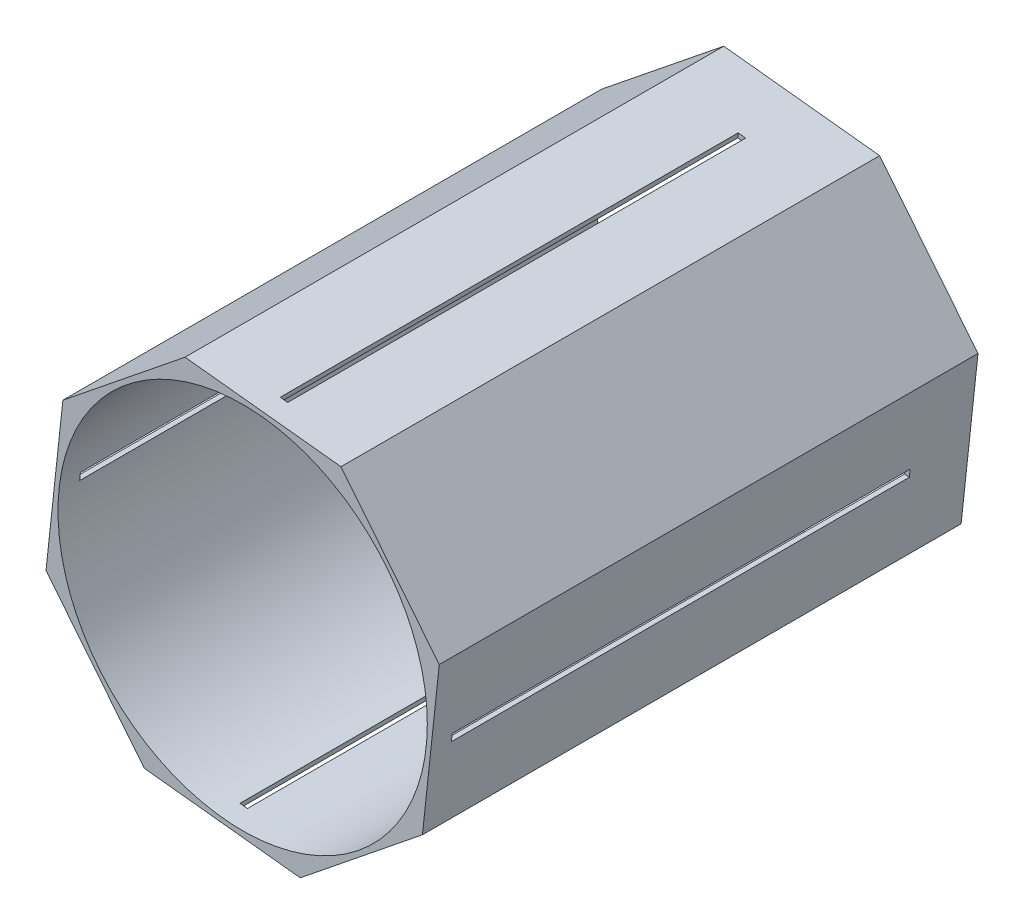
ISO-10303-21;
HEADER;
FILE_DESCRIPTION(('STEP AP214'),'2;1');
FILE_NAME('part.step','',(''),(''),'','','');
FILE_SCHEMA(('AUTOMOTIVE_DESIGN { 1 0 10303 214 1 1 1 1 }'));
ENDSEC;
DATA;
#1=APPLICATION_CONTEXT('core data for automotive mechanical design processes');
#2=APPLICATION_PROTOCOL_DEFINITION('international standard','automotive_design',2000,#1);
#3=PRODUCT_CONTEXT('',#1,'mechanical');
#4=PRODUCT('Part','Part','',(#3));
#5=PRODUCT_RELATED_PRODUCT_CATEGORY('part','',(#4));
#6=PRODUCT_DEFINITION_FORMATION('','',#4);
#7=PRODUCT_DEFINITION_CONTEXT('part definition',#1,'design');
#8=PRODUCT_DEFINITION('design','',#6,#7);
#9=PRODUCT_DEFINITION_SHAPE('','',#8);
#10=(LENGTH_UNIT() NAMED_UNIT(*) SI_UNIT(.MILLI.,.METRE.));
#11=(NAMED_UNIT(*) PLANE_ANGLE_UNIT() SI_UNIT($,.RADIAN.));
#12=(NAMED_UNIT(*) SI_UNIT($,.STERADIAN.) SOLID_ANGLE_UNIT());
#13=UNCERTAINTY_MEASURE_WITH_UNIT(LENGTH_MEASURE(1.E-05),#10,'distance_accuracy_value','');
#14=(GEOMETRIC_REPRESENTATION_CONTEXT(3) GLOBAL_UNCERTAINTY_ASSIGNED_CONTEXT((#13)) GLOBAL_UNIT_ASSIGNED_CONTEXT((#10,
#11,#12)) REPRESENTATION_CONTEXT('',''));
#15=CARTESIAN_POINT('',(0.,0.,0.));
#16=DIRECTION('',(0.,0.,1.));
#17=DIRECTION('',(1.,0.,0.));
#18=AXIS2_PLACEMENT_3D('',#15,#16,#17);
#19=CARTESIAN_POINT('',(0.,0.,228.6));
#20=DIRECTION('',(0.,0.,1.));
#21=DIRECTION('',(1.,0.,0.));
#22=AXIS2_PLACEMENT_3D('',#19,#20,#21);
#23=PLANE('',#22);
#24=DIRECTION('',(-0.626948126265606,0.779061003370112,0.));
#25=VECTOR('',#24,1.);
#26=CARTESIAN_POINT('',(83.4439513761568,24.4407495676559,228.6));
#27=LINE('',#26,#25);
#28=CARTESIAN_POINT('',(83.4439513761568,24.4407495676559,228.6));
#29=VERTEX_POINT('',#28);
#30=CARTESIAN_POINT('',(41.7215641105097,76.2860036236524,228.6));
#31=VERTEX_POINT('',#30);
#32=EDGE_CURVE('E290',#29,#31,#27,.T.);
#33=ORIENTED_EDGE('',*,*,#32,.T.);
#34=DIRECTION('',(-0.994198589975612,0.107560046906394,0.));
#35=VECTOR('',#34,1.);
#36=CARTESIAN_POINT('',(41.7215641105097,76.2860036236524,228.6));
#37=LINE('',#36,#35);
#38=CARTESIAN_POINT('',(-24.4407495676555,83.4439513761569,228.6));
#39=VERTEX_POINT('',#38);
#40=EDGE_CURVE('E293',#31,#39,#37,.T.);
#41=ORIENTED_EDGE('',*,*,#40,.T.);
#42=DIRECTION('',(-0.779061003370113,-0.626948126265605,0.));
#43=VECTOR('',#42,1.);
#44=CARTESIAN_POINT('',(-24.4407495676555,83.4439513761569,228.6));
#45=LINE('',#44,#43);
#46=CARTESIAN_POINT('',(-76.2860036236525,41.7215641105097,228.6));
#47=VERTEX_POINT('',#46);
#48=EDGE_CURVE('E296',#39,#47,#45,.T.);
#49=ORIENTED_EDGE('',*,*,#48,.T.);
#50=DIRECTION('',(-0.107560046906394,-0.994198589975612,0.));
#51=VECTOR('',#50,1.);
#52=CARTESIAN_POINT('',(-76.2860036236525,41.7215641105097,228.6));
#53=LINE('',#52,#51);
#54=CARTESIAN_POINT('',(-83.4439513761569,-24.4407495676555,228.6));
#55=VERTEX_POINT('',#54);
#56=EDGE_CURVE('E298',#47,#55,#53,.T.);
#57=ORIENTED_EDGE('',*,*,#56,.T.);
#58=DIRECTION('',(0.626948126265605,-0.779061003370113,0.));
#59=VECTOR('',#58,1.);
#60=CARTESIAN_POINT('',(-83.4439513761569,-24.4407495676555,228.6));
#61=LINE('',#60,#59);
#62=CARTESIAN_POINT('',(-41.7215641105097,-76.2860036236524,228.6));
#63=VERTEX_POINT('',#62);
#64=EDGE_CURVE('E300',#55,#63,#61,.T.);
#65=ORIENTED_EDGE('',*,*,#64,.T.);
#66=DIRECTION('',(0.994198589975612,-0.107560046906394,0.));
#67=VECTOR('',#66,1.);
#68=CARTESIAN_POINT('',(-41.7215641105097,-76.2860036236524,228.6));
#69=LINE('',#68,#67);
#70=CARTESIAN_POINT('',(24.4407495676555,-83.4439513761569,228.6));
#71=VERTEX_POINT('',#70);
#72=EDGE_CURVE('E302',#63,#71,#69,.T.);
#73=ORIENTED_EDGE('',*,*,#72,.T.);
#74=DIRECTION('',(0.779061003370112,0.626948126265606,0.));
#75=VECTOR('',#74,1.);
#76=CARTESIAN_POINT('',(24.4407495676555,-83.4439513761569,228.6));
#77=LINE('',#76,#75);
#78=CARTESIAN_POINT('',(76.2860036236526,-41.7215641105095,228.6));
#79=VERTEX_POINT('',#78);
#80=EDGE_CURVE('E304',#71,#79,#77,.T.);
#81=ORIENTED_EDGE('',*,*,#80,.T.);
#82=DIRECTION('',(0.107560046906391,0.994198589975612,0.));
#83=VECTOR('',#82,1.);
#84=CARTESIAN_POINT('',(76.2860036236526,-41.7215641105095,228.6));
#85=LINE('',#84,#83);
#86=EDGE_CURVE('E306',#79,#29,#85,.T.);
#87=ORIENTED_EDGE('',*,*,#86,.T.);
#88=EDGE_LOOP('',(#33,#41,#49,#57,#65,#73,#81,#87));
#89=FACE_BOUND('',#88,.T.);
#90=CARTESIAN_POINT('',(0.,0.,228.6));
#91=DIRECTION('',(0.,0.,1.));
#92=DIRECTION('',(1.,0.,0.));
#93=AXIS2_PLACEMENT_3D('',#90,#91,#92);
#94=CIRCLE('',#93,78.359);
#95=CARTESIAN_POINT('',(78.359,0.,228.6));
#96=VERTEX_POINT('',#95);
#97=EDGE_CURVE('E284',#96,#96,#94,.T.);
#98=ORIENTED_EDGE('',*,*,#97,.F.);
#99=EDGE_LOOP('',(#98));
#100=FACE_BOUND('',#99,.T.);
#101=ADVANCED_FACE('F37',(#89,#100),#23,.T.);
#102=CARTESIAN_POINT('',(0.,0.,0.));
#103=DIRECTION('',(0.,0.,1.));
#104=DIRECTION('',(1.,0.,0.));
#105=AXIS2_PLACEMENT_3D('',#102,#103,#104);
#106=PLANE('',#105);
#107=DIRECTION('',(-0.626948126265606,0.779061003370112,0.));
#108=VECTOR('',#107,1.);
#109=CARTESIAN_POINT('',(83.4439513761568,24.4407495676559,0.));
#110=LINE('',#109,#108);
#111=CARTESIAN_POINT('',(83.4439513761568,24.4407495676559,0.));
#112=VERTEX_POINT('',#111);
#113=CARTESIAN_POINT('',(41.7215641105097,76.2860036236524,0.));
#114=VERTEX_POINT('',#113);
#115=EDGE_CURVE('E287',#112,#114,#110,.T.);
#116=ORIENTED_EDGE('',*,*,#115,.F.);
#117=DIRECTION('',(0.107560046906391,0.994198589975612,0.));
#118=VECTOR('',#117,1.);
#119=CARTESIAN_POINT('',(76.2860036236526,-41.7215641105095,0.));
#120=LINE('',#119,#118);
#121=CARTESIAN_POINT('',(76.2860036236526,-41.7215641105095,0.));
#122=VERTEX_POINT('',#121);
#123=EDGE_CURVE('E294',#122,#112,#120,.T.);
#124=ORIENTED_EDGE('',*,*,#123,.F.);
#125=DIRECTION('',(0.779061003370112,0.626948126265606,0.));
#126=VECTOR('',#125,1.);
#127=CARTESIAN_POINT('',(24.4407495676555,-83.4439513761569,0.));
#128=LINE('',#127,#126);
#129=CARTESIAN_POINT('',(24.4407495676555,-83.4439513761569,0.));
#130=VERTEX_POINT('',#129);
#131=EDGE_CURVE('E321',#130,#122,#128,.T.);
#132=ORIENTED_EDGE('',*,*,#131,.F.);
#133=DIRECTION('',(0.994198589975612,-0.107560046906394,0.));
#134=VECTOR('',#133,1.);
#135=CARTESIAN_POINT('',(-41.7215641105097,-76.2860036236524,0.));
#136=LINE('',#135,#134);
#137=CARTESIAN_POINT('',(-41.7215641105097,-76.2860036236524,0.));
#138=VERTEX_POINT('',#137);
#139=EDGE_CURVE('E319',#138,#130,#136,.T.);
#140=ORIENTED_EDGE('',*,*,#139,.F.);
#141=DIRECTION('',(0.626948126265605,-0.779061003370113,0.));
#142=VECTOR('',#141,1.);
#143=CARTESIAN_POINT('',(-83.4439513761569,-24.4407495676555,0.));
#144=LINE('',#143,#142);
#145=CARTESIAN_POINT('',(-83.4439513761569,-24.4407495676555,0.));
#146=VERTEX_POINT('',#145);
#147=EDGE_CURVE('E317',#146,#138,#144,.T.);
#148=ORIENTED_EDGE('',*,*,#147,.F.);
#149=DIRECTION('',(-0.107560046906394,-0.994198589975612,0.));
#150=VECTOR('',#149,1.);
#151=CARTESIAN_POINT('',(-76.2860036236525,41.7215641105097,0.));
#152=LINE('',#151,#150);
#153=CARTESIAN_POINT('',(-76.2860036236525,41.7215641105097,0.));
#154=VERTEX_POINT('',#153);
#155=EDGE_CURVE('E315',#154,#146,#152,.T.);
#156=ORIENTED_EDGE('',*,*,#155,.F.);
#157=DIRECTION('',(-0.779061003370113,-0.626948126265605,0.));
#158=VECTOR('',#157,1.);
#159=CARTESIAN_POINT('',(-24.4407495676555,83.4439513761569,0.));
#160=LINE('',#159,#158);
#161=CARTESIAN_POINT('',(-24.4407495676555,83.4439513761569,0.));
#162=VERTEX_POINT('',#161);
#163=EDGE_CURVE('E313',#162,#154,#160,.T.);
#164=ORIENTED_EDGE('',*,*,#163,.F.);
#165=DIRECTION('',(-0.994198589975612,0.107560046906394,0.));
#166=VECTOR('',#165,1.);
#167=CARTESIAN_POINT('',(41.7215641105097,76.2860036236524,0.));
#168=LINE('',#167,#166);
#169=EDGE_CURVE('E311',#114,#162,#168,.T.);
#170=ORIENTED_EDGE('',*,*,#169,.F.);
#171=EDGE_LOOP('',(#116,#124,#132,#140,#148,#156,#164,#170));
#172=FACE_BOUND('',#171,.T.);
#173=CARTESIAN_POINT('',(0.,0.,0.));
#174=DIRECTION('',(0.,0.,1.));
#175=DIRECTION('',(1.,0.,0.));
#176=AXIS2_PLACEMENT_3D('',#173,#174,#175);
#177=CIRCLE('',#176,78.359);
#178=CARTESIAN_POINT('',(78.359,0.,0.));
#179=VERTEX_POINT('',#178);
#180=EDGE_CURVE('E283',#179,#179,#177,.T.);
#181=ORIENTED_EDGE('',*,*,#180,.T.);
#182=EDGE_LOOP('',(#181));
#183=FACE_BOUND('',#182,.T.);
#184=ADVANCED_FACE('F405',(#172,#183),#106,.F.);
#185=CARTESIAN_POINT('',(83.4439513761568,24.4407495676559,228.6));
#186=DIRECTION('',(-0.779061003370112,-0.626948126265606,0.));
#187=DIRECTION('',(0.626948126265606,-0.779061003370112,0.));
#188=AXIS2_PLACEMENT_3D('',#185,#186,#187);
#189=PLANE('',#188);
#190=ORIENTED_EDGE('',*,*,#115,.T.);
#191=DIRECTION('',(0.,0.,-1.));
#192=VECTOR('',#191,1.);
#193=CARTESIAN_POINT('',(41.7215641105097,76.2860036236524,228.6));
#194=LINE('',#193,#192);
#195=EDGE_CURVE('E344',#31,#114,#194,.T.);
#196=ORIENTED_EDGE('',*,*,#195,.F.);
#197=ORIENTED_EDGE('',*,*,#32,.F.);
#198=DIRECTION('',(0.,0.,-1.));
#199=VECTOR('',#198,1.);
#200=CARTESIAN_POINT('',(83.4439513761568,24.4407495676559,228.6));
#201=LINE('',#200,#199);
#202=EDGE_CURVE('E308',#29,#112,#201,.T.);
#203=ORIENTED_EDGE('',*,*,#202,.T.);
#204=EDGE_LOOP('',(#190,#196,#197,#203));
#205=FACE_BOUND('',#204,.T.);
#206=ADVANCED_FACE('F39',(#205),#189,.F.);
#207=CARTESIAN_POINT('',(41.7215641105097,76.2860036236524,228.6));
#208=DIRECTION('',(-0.107560046906394,-0.994198589975612,0.));
#209=DIRECTION('',(0.994198589975612,-0.107560046906394,0.));
#210=AXIS2_PLACEMENT_3D('',#207,#208,#209);
#211=PLANE('',#210);
#212=DIRECTION('',(-0.994198589975612,0.107560046906396,0.));
#213=VECTOR('',#212,1.);
#214=CARTESIAN_POINT('',(7.06211700984079,80.0357290743685,25.4000000000001));
#215=LINE('',#214,#213);
#216=CARTESIAN_POINT('',(10.2186975330133,79.6942259254408,25.4000000000001));
#217=VERTEX_POINT('',#216);
#218=CARTESIAN_POINT('',(7.06211700984079,80.0357290743685,25.4000000000001));
#219=VERTEX_POINT('',#218);
#220=EDGE_CURVE('E249',#217,#219,#215,.T.);
#221=ORIENTED_EDGE('',*,*,#220,.F.);
#222=DIRECTION('',(0.,0.,-1.));
#223=VECTOR('',#222,1.);
#224=CARTESIAN_POINT('',(10.2186975330134,79.6942259254407,25.4000000000001));
#225=LINE('',#224,#223);
#226=CARTESIAN_POINT('',(10.2186975330134,79.6942259254407,219.71));
#227=VERTEX_POINT('',#226);
#228=EDGE_CURVE('E247',#227,#217,#225,.T.);
#229=ORIENTED_EDGE('',*,*,#228,.F.);
#230=DIRECTION('',(0.994198589975612,-0.107560046906393,0.));
#231=VECTOR('',#230,1.);
#232=CARTESIAN_POINT('',(7.06211700984083,80.0357290743685,219.71));
#233=LINE('',#232,#231);
#234=CARTESIAN_POINT('',(7.06211700984083,80.0357290743685,219.71));
#235=VERTEX_POINT('',#234);
#236=EDGE_CURVE('E255',#235,#227,#233,.T.);
#237=ORIENTED_EDGE('',*,*,#236,.F.);
#238=DIRECTION('',(0.,0.,1.));
#239=VECTOR('',#238,1.);
#240=CARTESIAN_POINT('',(7.06211700984079,80.0357290743685,25.4000000000001));
#241=LINE('',#240,#239);
#242=EDGE_CURVE('E252',#219,#235,#241,.T.);
#243=ORIENTED_EDGE('',*,*,#242,.F.);
#244=EDGE_LOOP('',(#221,#229,#237,#243));
#245=FACE_BOUND('',#244,.T.);
#246=ORIENTED_EDGE('',*,*,#169,.T.);
#247=DIRECTION('',(0.,0.,-1.));
#248=VECTOR('',#247,1.);
#249=CARTESIAN_POINT('',(-24.4407495676555,83.4439513761569,228.6));
#250=LINE('',#249,#248);
#251=EDGE_CURVE('E341',#39,#162,#250,.T.);
#252=ORIENTED_EDGE('',*,*,#251,.F.);
#253=ORIENTED_EDGE('',*,*,#40,.F.);
#254=ORIENTED_EDGE('',*,*,#195,.T.);
#255=EDGE_LOOP('',(#246,#252,#253,#254));
#256=FACE_BOUND('',#255,.T.);
#257=ADVANCED_FACE('F413',(#245,#256),#211,.F.);
#258=CARTESIAN_POINT('',(-24.4407495676555,83.4439513761569,228.6));
#259=DIRECTION('',(0.626948126265605,-0.779061003370113,0.));
#260=DIRECTION('',(0.779061003370113,0.626948126265605,0.));
#261=AXIS2_PLACEMENT_3D('',#258,#259,#260);
#262=PLANE('',#261);
#263=ORIENTED_EDGE('',*,*,#163,.T.);
#264=DIRECTION('',(0.,0.,-1.));
#265=VECTOR('',#264,1.);
#266=CARTESIAN_POINT('',(-76.2860036236525,41.7215641105097,228.6));
#267=LINE('',#266,#265);
#268=EDGE_CURVE('E338',#47,#154,#267,.T.);
#269=ORIENTED_EDGE('',*,*,#268,.F.);
#270=ORIENTED_EDGE('',*,*,#48,.F.);
#271=ORIENTED_EDGE('',*,*,#251,.T.);
#272=EDGE_LOOP('',(#263,#269,#270,#271));
#273=FACE_BOUND('',#272,.T.);
#274=ADVANCED_FACE('F436',(#273),#262,.F.);
#275=CARTESIAN_POINT('',(-76.2860036236525,41.7215641105097,228.6));
#276=DIRECTION('',(0.994198589975612,-0.107560046906394,0.));
#277=DIRECTION('',(0.107560046906394,0.994198589975612,0.));
#278=AXIS2_PLACEMENT_3D('',#275,#276,#277);
#279=PLANE('',#278);
#280=DIRECTION('',(0.,0.,-1.));
#281=VECTOR('',#280,1.);
#282=CARTESIAN_POINT('',(-79.6942259254407,10.2186975330133,25.4));
#283=LINE('',#282,#281);
#284=CARTESIAN_POINT('',(-79.6942259254408,10.2186975330134,219.71));
#285=VERTEX_POINT('',#284);
#286=CARTESIAN_POINT('',(-79.6942259254407,10.2186975330133,25.4));
#287=VERTEX_POINT('',#286);
#288=EDGE_CURVE('E215',#285,#287,#283,.T.);
#289=ORIENTED_EDGE('',*,*,#288,.F.);
#290=DIRECTION('',(0.107560046906395,0.994198589975612,0.));
#291=VECTOR('',#290,1.);
#292=CARTESIAN_POINT('',(-80.0357290743685,7.06211700984078,219.71));
#293=LINE('',#292,#291);
#294=CARTESIAN_POINT('',(-80.0357290743685,7.06211700984078,219.71));
#295=VERTEX_POINT('',#294);
#296=EDGE_CURVE('E54',#295,#285,#293,.T.);
#297=ORIENTED_EDGE('',*,*,#296,.F.);
#298=DIRECTION('',(0.,0.,1.));
#299=VECTOR('',#298,1.);
#300=CARTESIAN_POINT('',(-80.0357290743685,7.06211700984078,25.4));
#301=LINE('',#300,#299);
#302=CARTESIAN_POINT('',(-80.0357290743685,7.06211700984078,25.4));
#303=VERTEX_POINT('',#302);
#304=EDGE_CURVE('E223',#303,#295,#301,.T.);
#305=ORIENTED_EDGE('',*,*,#304,.F.);
#306=DIRECTION('',(-0.107560046906396,-0.994198589975612,0.));
#307=VECTOR('',#306,1.);
#308=CARTESIAN_POINT('',(-80.0357290743685,7.06211700984078,25.4));
#309=LINE('',#308,#307);
#310=EDGE_CURVE('E206',#287,#303,#309,.T.);
#311=ORIENTED_EDGE('',*,*,#310,.F.);
#312=EDGE_LOOP('',(#289,#297,#305,#311));
#313=FACE_BOUND('',#312,.T.);
#314=ORIENTED_EDGE('',*,*,#155,.T.);
#315=DIRECTION('',(0.,0.,-1.));
#316=VECTOR('',#315,1.);
#317=CARTESIAN_POINT('',(-83.4439513761569,-24.4407495676555,228.6));
#318=LINE('',#317,#316);
#319=EDGE_CURVE('E335',#55,#146,#318,.T.);
#320=ORIENTED_EDGE('',*,*,#319,.F.);
#321=ORIENTED_EDGE('',*,*,#56,.F.);
#322=ORIENTED_EDGE('',*,*,#268,.T.);
#323=EDGE_LOOP('',(#314,#320,#321,#322));
#324=FACE_BOUND('',#323,.T.);
#325=ADVANCED_FACE('F220',(#313,#324),#279,.F.);
#326=CARTESIAN_POINT('',(-83.4439513761569,-24.4407495676555,228.6));
#327=DIRECTION('',(0.779061003370113,0.626948126265605,0.));
#328=DIRECTION('',(-0.626948126265605,0.779061003370113,0.));
#329=AXIS2_PLACEMENT_3D('',#326,#327,#328);
#330=PLANE('',#329);
#331=ORIENTED_EDGE('',*,*,#147,.T.);
#332=DIRECTION('',(0.,0.,-1.));
#333=VECTOR('',#332,1.);
#334=CARTESIAN_POINT('',(-41.7215641105097,-76.2860036236524,228.6));
#335=LINE('',#334,#333);
#336=EDGE_CURVE('E332',#63,#138,#335,.T.);
#337=ORIENTED_EDGE('',*,*,#336,.F.);
#338=ORIENTED_EDGE('',*,*,#64,.F.);
#339=ORIENTED_EDGE('',*,*,#319,.T.);
#340=EDGE_LOOP('',(#331,#337,#338,#339));
#341=FACE_BOUND('',#340,.T.);
#342=ADVANCED_FACE('F429',(#341),#330,.F.);
#343=CARTESIAN_POINT('',(-41.7215641105097,-76.2860036236524,228.6));
#344=DIRECTION('',(0.107560046906394,0.994198589975612,0.));
#345=DIRECTION('',(-0.994198589975612,0.107560046906394,0.));
#346=AXIS2_PLACEMENT_3D('',#343,#344,#345);
#347=PLANE('',#346);
#348=DIRECTION('',(0.994198589975612,-0.107560046906394,0.));
#349=VECTOR('',#348,1.);
#350=CARTESIAN_POINT('',(-41.7215641105097,-76.2860036236524,219.71));
#351=LINE('',#350,#349);
#352=CARTESIAN_POINT('',(-10.2186975330133,-79.6942259254408,219.71));
#353=VERTEX_POINT('',#352);
#354=CARTESIAN_POINT('',(-7.06211700984078,-80.0357290743686,219.71));
#355=VERTEX_POINT('',#354);
#356=EDGE_CURVE('E277',#353,#355,#351,.T.);
#357=ORIENTED_EDGE('',*,*,#356,.T.);
#358=DIRECTION('',(0.,0.,-1.));
#359=VECTOR('',#358,1.);
#360=CARTESIAN_POINT('',(-7.06211700984077,-80.0357290743685,228.6));
#361=LINE('',#360,#359);
#362=CARTESIAN_POINT('',(-7.0621170098408,-80.0357290743686,25.4));
#363=VERTEX_POINT('',#362);
#364=EDGE_CURVE('E280',#355,#363,#361,.T.);
#365=ORIENTED_EDGE('',*,*,#364,.T.);
#366=DIRECTION('',(-0.994198589975612,0.107560046906394,0.));
#367=VECTOR('',#366,1.);
#368=CARTESIAN_POINT('',(-41.7215641105097,-76.2860036236524,25.4));
#369=LINE('',#368,#367);
#370=CARTESIAN_POINT('',(-10.2186975330134,-79.6942259254408,25.4));
#371=VERTEX_POINT('',#370);
#372=EDGE_CURVE('E271',#363,#371,#369,.T.);
#373=ORIENTED_EDGE('',*,*,#372,.T.);
#374=DIRECTION('',(0.,0.,1.));
#375=VECTOR('',#374,1.);
#376=CARTESIAN_POINT('',(-10.2186975330133,-79.6942259254408,228.6));
#377=LINE('',#376,#375);
#378=EDGE_CURVE('E274',#371,#353,#377,.T.);
#379=ORIENTED_EDGE('',*,*,#378,.T.);
#380=EDGE_LOOP('',(#357,#365,#373,#379));
#381=FACE_BOUND('',#380,.T.);
#382=ORIENTED_EDGE('',*,*,#139,.T.);
#383=DIRECTION('',(0.,0.,-1.));
#384=VECTOR('',#383,1.);
#385=CARTESIAN_POINT('',(24.4407495676555,-83.4439513761569,228.6));
#386=LINE('',#385,#384);
#387=EDGE_CURVE('E329',#71,#130,#386,.T.);
#388=ORIENTED_EDGE('',*,*,#387,.F.);
#389=ORIENTED_EDGE('',*,*,#72,.F.);
#390=ORIENTED_EDGE('',*,*,#336,.T.);
#391=EDGE_LOOP('',(#382,#388,#389,#390));
#392=FACE_BOUND('',#391,.T.);
#393=ADVANCED_FACE('F425',(#381,#392),#347,.F.);
#394=CARTESIAN_POINT('',(24.4407495676555,-83.4439513761569,228.6));
#395=DIRECTION('',(-0.626948126265606,0.779061003370113,0.));
#396=DIRECTION('',(-0.779061003370112,-0.626948126265606,0.));
#397=AXIS2_PLACEMENT_3D('',#394,#395,#396);
#398=PLANE('',#397);
#399=ORIENTED_EDGE('',*,*,#131,.T.);
#400=DIRECTION('',(0.,0.,-1.));
#401=VECTOR('',#400,1.);
#402=CARTESIAN_POINT('',(76.2860036236526,-41.7215641105095,228.6));
#403=LINE('',#402,#401);
#404=EDGE_CURVE('E326',#79,#122,#403,.T.);
#405=ORIENTED_EDGE('',*,*,#404,.F.);
#406=ORIENTED_EDGE('',*,*,#80,.F.);
#407=ORIENTED_EDGE('',*,*,#387,.T.);
#408=EDGE_LOOP('',(#399,#405,#406,#407));
#409=FACE_BOUND('',#408,.T.);
#410=ADVANCED_FACE('F421',(#409),#398,.F.);
#411=CARTESIAN_POINT('',(76.2860036236526,-41.7215641105095,228.6));
#412=DIRECTION('',(-0.994198589975612,0.107560046906391,0.));
#413=DIRECTION('',(-0.107560046906391,-0.994198589975612,0.));
#414=AXIS2_PLACEMENT_3D('',#411,#412,#413);
#415=PLANE('',#414);
#416=DIRECTION('',(0.,0.,1.));
#417=VECTOR('',#416,1.);
#418=CARTESIAN_POINT('',(79.6942259254407,-10.2186975330134,228.6));
#419=LINE('',#418,#417);
#420=CARTESIAN_POINT('',(79.6942259254407,-10.2186975330134,25.4));
#421=VERTEX_POINT('',#420);
#422=CARTESIAN_POINT('',(79.6942259254407,-10.2186975330134,219.71));
#423=VERTEX_POINT('',#422);
#424=EDGE_CURVE('E241',#421,#423,#419,.T.);
#425=ORIENTED_EDGE('',*,*,#424,.T.);
#426=DIRECTION('',(0.107560046906391,0.994198589975612,0.));
#427=VECTOR('',#426,1.);
#428=CARTESIAN_POINT('',(76.2860036236526,-41.7215641105095,219.71));
#429=LINE('',#428,#427);
#430=CARTESIAN_POINT('',(80.0357290743685,-7.06211700984077,219.71));
#431=VERTEX_POINT('',#430);
#432=EDGE_CURVE('E244',#423,#431,#429,.T.);
#433=ORIENTED_EDGE('',*,*,#432,.T.);
#434=DIRECTION('',(0.,0.,-1.));
#435=VECTOR('',#434,1.);
#436=CARTESIAN_POINT('',(80.0357290743685,-7.06211700984076,228.6));
#437=LINE('',#436,#435);
#438=CARTESIAN_POINT('',(80.0357290743685,-7.06211700984081,25.4));
#439=VERTEX_POINT('',#438);
#440=EDGE_CURVE('E235',#431,#439,#437,.T.);
#441=ORIENTED_EDGE('',*,*,#440,.T.);
#442=DIRECTION('',(-0.107560046906391,-0.994198589975612,0.));
#443=VECTOR('',#442,1.);
#444=CARTESIAN_POINT('',(76.2860036236526,-41.7215641105095,25.4));
#445=LINE('',#444,#443);
#446=EDGE_CURVE('E238',#439,#421,#445,.T.);
#447=ORIENTED_EDGE('',*,*,#446,.T.);
#448=EDGE_LOOP('',(#425,#433,#441,#447));
#449=FACE_BOUND('',#448,.T.);
#450=ORIENTED_EDGE('',*,*,#123,.T.);
#451=ORIENTED_EDGE('',*,*,#202,.F.);
#452=ORIENTED_EDGE('',*,*,#86,.F.);
#453=ORIENTED_EDGE('',*,*,#404,.T.);
#454=EDGE_LOOP('',(#450,#451,#452,#453));
#455=FACE_BOUND('',#454,.T.);
#456=ADVANCED_FACE('F388',(#449,#455),#415,.F.);
#457=CARTESIAN_POINT('',(0.,0.,228.6));
#458=DIRECTION('',(0.,0.,-1.));
#459=DIRECTION('',(-1.,0.,0.));
#460=AXIS2_PLACEMENT_3D('',#457,#458,#459);
#461=CYLINDRICAL_SURFACE('',#460,78.359);
#462=CARTESIAN_POINT('',(0.,0.,219.71));
#463=DIRECTION('',(0.,0.,1.));
#464=DIRECTION('',(1.,0.,0.));
#465=AXIS2_PLACEMENT_3D('',#462,#463,#464);
#466=CIRCLE('',#465,78.359);
#467=CARTESIAN_POINT('',(77.717666553448,-10.0048581442751,219.71));
#468=VERTEX_POINT('',#467);
#469=CARTESIAN_POINT('',(78.0591697023758,-6.84827762110253,219.71));
#470=VERTEX_POINT('',#469);
#471=EDGE_CURVE('E11',#468,#470,#466,.T.);
#472=ORIENTED_EDGE('',*,*,#471,.F.);
#473=DIRECTION('',(0.,0.,-1.));
#474=VECTOR('',#473,1.);
#475=CARTESIAN_POINT('',(77.717666553448,-10.0048581442751,228.6));
#476=LINE('',#475,#474);
#477=CARTESIAN_POINT('',(77.717666553448,-10.0048581442751,25.4));
#478=VERTEX_POINT('',#477);
#479=EDGE_CURVE('E41',#478,#468,#476,.F.);
#480=ORIENTED_EDGE('',*,*,#479,.F.);
#481=CARTESIAN_POINT('',(0.,0.,25.4));
#482=DIRECTION('',(0.,0.,-1.));
#483=DIRECTION('',(-1.,0.,0.));
#484=AXIS2_PLACEMENT_3D('',#481,#482,#483);
#485=CIRCLE('',#484,78.359);
#486=CARTESIAN_POINT('',(78.0591697023758,-6.84827762110257,25.4));
#487=VERTEX_POINT('',#486);
#488=EDGE_CURVE('E367',#487,#478,#485,.T.);
#489=ORIENTED_EDGE('',*,*,#488,.F.);
#490=DIRECTION('',(0.,0.,-1.));
#491=VECTOR('',#490,1.);
#492=CARTESIAN_POINT('',(78.0591697023758,-6.84827762110253,228.6));
#493=LINE('',#492,#491);
#494=EDGE_CURVE('E368',#470,#487,#493,.T.);
#495=ORIENTED_EDGE('',*,*,#494,.F.);
#496=EDGE_LOOP('',(#472,#480,#489,#495));
#497=FACE_BOUND('',#496,.T.);
#498=CARTESIAN_POINT('',(-77.717666553448,10.0048581442751,219.71));
#499=VERTEX_POINT('',#498);
#500=CARTESIAN_POINT('',(-78.0591697023758,6.84827762110254,219.71));
#501=VERTEX_POINT('',#500);
#502=EDGE_CURVE('E47',#499,#501,#466,.T.);
#503=ORIENTED_EDGE('',*,*,#502,.F.);
#504=DIRECTION('',(0.,0.,-1.));
#505=VECTOR('',#504,1.);
#506=CARTESIAN_POINT('',(-77.717666553448,10.0048581442751,228.6));
#507=LINE('',#506,#505);
#508=CARTESIAN_POINT('',(-77.717666553448,10.0048581442751,25.4));
#509=VERTEX_POINT('',#508);
#510=EDGE_CURVE('E363',#509,#499,#507,.F.);
#511=ORIENTED_EDGE('',*,*,#510,.F.);
#512=CARTESIAN_POINT('',(-78.0591697023758,6.84827762110254,25.4));
#513=VERTEX_POINT('',#512);
#514=EDGE_CURVE('E209',#513,#509,#485,.T.);
#515=ORIENTED_EDGE('',*,*,#514,.F.);
#516=DIRECTION('',(0.,0.,-1.));
#517=VECTOR('',#516,1.);
#518=CARTESIAN_POINT('',(-78.0591697023758,6.84827762110254,228.6));
#519=LINE('',#518,#517);
#520=EDGE_CURVE('E366',#501,#513,#519,.T.);
#521=ORIENTED_EDGE('',*,*,#520,.F.);
#522=EDGE_LOOP('',(#503,#511,#515,#521));
#523=FACE_BOUND('',#522,.T.);
#524=DIRECTION('',(0.,0.,-1.));
#525=VECTOR('',#524,1.);
#526=CARTESIAN_POINT('',(10.0048581442751,77.717666553448,228.6));
#527=LINE('',#526,#525);
#528=CARTESIAN_POINT('',(10.0048581442751,77.717666553448,25.4000000000001));
#529=VERTEX_POINT('',#528);
#530=CARTESIAN_POINT('',(10.0048581442751,77.717666553448,219.71));
#531=VERTEX_POINT('',#530);
#532=EDGE_CURVE('E361',#529,#531,#527,.F.);
#533=ORIENTED_EDGE('',*,*,#532,.F.);
#534=CARTESIAN_POINT('',(0.,0.,25.4000000000001));
#535=DIRECTION('',(0.,0.,-1.));
#536=DIRECTION('',(-1.,0.,0.));
#537=AXIS2_PLACEMENT_3D('',#534,#535,#536);
#538=CIRCLE('',#537,78.359);
#539=CARTESIAN_POINT('',(6.84827762110254,78.0591697023758,25.4000000000001));
#540=VERTEX_POINT('',#539);
#541=EDGE_CURVE('E350',#540,#529,#538,.T.);
#542=ORIENTED_EDGE('',*,*,#541,.F.);
#543=DIRECTION('',(0.,0.,-1.));
#544=VECTOR('',#543,1.);
#545=CARTESIAN_POINT('',(6.84827762110259,78.0591697023758,228.6));
#546=LINE('',#545,#544);
#547=CARTESIAN_POINT('',(6.84827762110259,78.0591697023758,219.71));
#548=VERTEX_POINT('',#547);
#549=EDGE_CURVE('E358',#548,#540,#546,.T.);
#550=ORIENTED_EDGE('',*,*,#549,.F.);
#551=CARTESIAN_POINT('',(0.,0.,219.71));
#552=DIRECTION('',(0.,0.,1.));
#553=DIRECTION('',(1.,0.,0.));
#554=AXIS2_PLACEMENT_3D('',#551,#552,#553);
#555=CIRCLE('',#554,78.359);
#556=EDGE_CURVE('E355',#531,#548,#555,.T.);
#557=ORIENTED_EDGE('',*,*,#556,.F.);
#558=EDGE_LOOP('',(#533,#542,#550,#557));
#559=FACE_BOUND('',#558,.T.);
#560=DIRECTION('',(0.,0.,-1.));
#561=VECTOR('',#560,1.);
#562=CARTESIAN_POINT('',(-6.84827762110253,-78.0591697023758,228.6));
#563=LINE('',#562,#561);
#564=CARTESIAN_POINT('',(-6.84827762110253,-78.0591697023758,219.71));
#565=VERTEX_POINT('',#564);
#566=CARTESIAN_POINT('',(-6.84827762110256,-78.0591697023758,25.4000000000001));
#567=VERTEX_POINT('',#566);
#568=EDGE_CURVE('E354',#565,#567,#563,.T.);
#569=ORIENTED_EDGE('',*,*,#568,.F.);
#570=CARTESIAN_POINT('',(-10.0048581442751,-77.717666553448,219.71));
#571=VERTEX_POINT('',#570);
#572=EDGE_CURVE('E352',#571,#565,#555,.T.);
#573=ORIENTED_EDGE('',*,*,#572,.F.);
#574=DIRECTION('',(0.,0.,-1.));
#575=VECTOR('',#574,1.);
#576=CARTESIAN_POINT('',(-10.0048581442751,-77.717666553448,228.6));
#577=LINE('',#576,#575);
#578=CARTESIAN_POINT('',(-10.0048581442751,-77.717666553448,25.4000000000001));
#579=VERTEX_POINT('',#578);
#580=EDGE_CURVE('E349',#579,#571,#577,.F.);
#581=ORIENTED_EDGE('',*,*,#580,.F.);
#582=EDGE_CURVE('E347',#567,#579,#538,.T.);
#583=ORIENTED_EDGE('',*,*,#582,.F.);
#584=EDGE_LOOP('',(#569,#573,#581,#583));
#585=FACE_BOUND('',#584,.T.);
#586=ORIENTED_EDGE('',*,*,#97,.T.);
#587=EDGE_LOOP('',(#586));
#588=FACE_BOUND('',#587,.T.);
#589=ORIENTED_EDGE('',*,*,#180,.F.);
#590=EDGE_LOOP('',(#589));
#591=FACE_BOUND('',#590,.T.);
#592=ADVANCED_FACE('F384',(#497,#523,#559,#585,#588,#591),#461,.F.);
#593=CARTESIAN_POINT('',(-14.7940845215384,-121.985424408676,25.4000000000001));
#594=DIRECTION('',(0.,0.,-1.));
#595=DIRECTION('',(-1.,0.,0.));
#596=AXIS2_PLACEMENT_3D('',#593,#594,#595);
#597=PLANE('',#596);
#598=DIRECTION('',(0.107560046906394,0.994198589975612,0.));
#599=VECTOR('',#598,1.);
#600=CARTESIAN_POINT('',(-11.6375039983659,-122.326927557604,25.4000000000001));
#601=LINE('',#600,#599);
#602=EDGE_CURVE('E268',#363,#567,#601,.T.);
#603=ORIENTED_EDGE('',*,*,#602,.T.);
#604=ORIENTED_EDGE('',*,*,#582,.T.);
#605=DIRECTION('',(0.107560046906394,0.994198589975612,0.));
#606=VECTOR('',#605,1.);
#607=CARTESIAN_POINT('',(-14.7940845215384,-121.985424408676,25.4000000000001));
#608=LINE('',#607,#606);
#609=EDGE_CURVE('E265',#371,#579,#608,.T.);
#610=ORIENTED_EDGE('',*,*,#609,.F.);
#611=ORIENTED_EDGE('',*,*,#372,.F.);
#612=EDGE_LOOP('',(#603,#604,#610,#611));
#613=FACE_BOUND('',#612,.T.);
#614=ADVANCED_FACE('F387',(#613),#597,.F.);
#615=CARTESIAN_POINT('',(-14.7940845215384,-121.985424408676,25.4000000000001));
#616=DIRECTION('',(-0.994198589975612,0.107560046906394,0.));
#617=DIRECTION('',(-0.107560046906394,-0.994198589975612,0.));
#618=AXIS2_PLACEMENT_3D('',#615,#616,#617);
#619=PLANE('',#618);
#620=ORIENTED_EDGE('',*,*,#609,.T.);
#621=ORIENTED_EDGE('',*,*,#580,.T.);
#622=DIRECTION('',(0.107560046906394,0.994198589975612,0.));
#623=VECTOR('',#622,1.);
#624=CARTESIAN_POINT('',(-14.7940845215384,-121.985424408676,219.71));
#625=LINE('',#624,#623);
#626=EDGE_CURVE('E262',#353,#571,#625,.T.);
#627=ORIENTED_EDGE('',*,*,#626,.F.);
#628=ORIENTED_EDGE('',*,*,#378,.F.);
#629=EDGE_LOOP('',(#620,#621,#627,#628));
#630=FACE_BOUND('',#629,.T.);
#631=ADVANCED_FACE('F486',(#630),#619,.F.);
#632=CARTESIAN_POINT('',(-14.7940845215384,-121.985424408676,219.71));
#633=DIRECTION('',(0.,0.,1.));
#634=DIRECTION('',(1.,0.,0.));
#635=AXIS2_PLACEMENT_3D('',#632,#633,#634);
#636=PLANE('',#635);
#637=ORIENTED_EDGE('',*,*,#626,.T.);
#638=ORIENTED_EDGE('',*,*,#572,.T.);
#639=DIRECTION('',(0.107560046906394,0.994198589975612,0.));
#640=VECTOR('',#639,1.);
#641=CARTESIAN_POINT('',(-11.6375039983658,-122.326927557604,219.71));
#642=LINE('',#641,#640);
#643=EDGE_CURVE('E261',#355,#565,#642,.T.);
#644=ORIENTED_EDGE('',*,*,#643,.F.);
#645=ORIENTED_EDGE('',*,*,#356,.F.);
#646=EDGE_LOOP('',(#637,#638,#644,#645));
#647=FACE_BOUND('',#646,.T.);
#648=ADVANCED_FACE('F494',(#647),#636,.F.);
#649=CARTESIAN_POINT('',(-11.6375039983659,-122.326927557604,25.4000000000001));
#650=DIRECTION('',(0.994198589975612,-0.107560046906394,0.));
#651=DIRECTION('',(0.107560046906394,0.994198589975612,0.));
#652=AXIS2_PLACEMENT_3D('',#649,#650,#651);
#653=PLANE('',#652);
#654=ORIENTED_EDGE('',*,*,#643,.T.);
#655=ORIENTED_EDGE('',*,*,#568,.T.);
#656=ORIENTED_EDGE('',*,*,#602,.F.);
#657=ORIENTED_EDGE('',*,*,#364,.F.);
#658=EDGE_LOOP('',(#654,#655,#656,#657));
#659=FACE_BOUND('',#658,.T.);
#660=ADVANCED_FACE('F492',(#659),#653,.F.);
#661=ORIENTED_EDGE('',*,*,#556,.T.);
#662=EDGE_CURVE('E263',#548,#235,#625,.T.);
#663=ORIENTED_EDGE('',*,*,#662,.T.);
#664=ORIENTED_EDGE('',*,*,#236,.T.);
#665=EDGE_CURVE('E259',#531,#227,#642,.T.);
#666=ORIENTED_EDGE('',*,*,#665,.F.);
#667=EDGE_LOOP('',(#661,#663,#664,#666));
#668=FACE_BOUND('',#667,.T.);
#669=ADVANCED_FACE('F479',(#668),#636,.F.);
#670=ORIENTED_EDGE('',*,*,#549,.T.);
#671=EDGE_CURVE('E266',#540,#219,#608,.T.);
#672=ORIENTED_EDGE('',*,*,#671,.T.);
#673=ORIENTED_EDGE('',*,*,#242,.T.);
#674=ORIENTED_EDGE('',*,*,#662,.F.);
#675=EDGE_LOOP('',(#670,#672,#673,#674));
#676=FACE_BOUND('',#675,.T.);
#677=ADVANCED_FACE('F483',(#676),#619,.F.);
#678=ORIENTED_EDGE('',*,*,#541,.T.);
#679=EDGE_CURVE('E258',#529,#217,#601,.T.);
#680=ORIENTED_EDGE('',*,*,#679,.T.);
#681=ORIENTED_EDGE('',*,*,#220,.T.);
#682=ORIENTED_EDGE('',*,*,#671,.F.);
#683=EDGE_LOOP('',(#678,#680,#681,#682));
#684=FACE_BOUND('',#683,.T.);
#685=ADVANCED_FACE('F473',(#684),#597,.F.);
#686=ORIENTED_EDGE('',*,*,#532,.T.);
#687=ORIENTED_EDGE('',*,*,#665,.T.);
#688=ORIENTED_EDGE('',*,*,#228,.T.);
#689=ORIENTED_EDGE('',*,*,#679,.F.);
#690=EDGE_LOOP('',(#686,#687,#688,#689));
#691=FACE_BOUND('',#690,.T.);
#692=ADVANCED_FACE('F476',(#691),#653,.F.);
#693=CARTESIAN_POINT('',(122.326927557604,-11.6375039983659,25.4));
#694=DIRECTION('',(0.107560046906394,0.994198589975612,0.));
#695=DIRECTION('',(-0.994198589975612,0.107560046906394,0.));
#696=AXIS2_PLACEMENT_3D('',#693,#694,#695);
#697=PLANE('',#696);
#698=ORIENTED_EDGE('',*,*,#510,.T.);
#699=DIRECTION('',(-0.994198589975612,0.107560046906394,0.));
#700=VECTOR('',#699,1.);
#701=CARTESIAN_POINT('',(122.326927557604,-11.6375039983658,219.71));
#702=LINE('',#701,#700);
#703=EDGE_CURVE('E217',#499,#285,#702,.T.);
#704=ORIENTED_EDGE('',*,*,#703,.T.);
#705=ORIENTED_EDGE('',*,*,#288,.T.);
#706=DIRECTION('',(-0.994198589975612,0.107560046906394,0.));
#707=VECTOR('',#706,1.);
#708=CARTESIAN_POINT('',(122.326927557604,-11.6375039983659,25.4));
#709=LINE('',#708,#707);
#710=EDGE_CURVE('E201',#509,#287,#709,.T.);
#711=ORIENTED_EDGE('',*,*,#710,.F.);
#712=EDGE_LOOP('',(#698,#704,#705,#711));
#713=FACE_BOUND('',#712,.T.);
#714=ADVANCED_FACE('F216',(#713),#697,.F.);
#715=CARTESIAN_POINT('',(121.985424408676,-14.7940845215384,25.4));
#716=DIRECTION('',(0.,0.,-1.));
#717=DIRECTION('',(-1.,0.,0.));
#718=AXIS2_PLACEMENT_3D('',#715,#716,#717);
#719=PLANE('',#718);
#720=ORIENTED_EDGE('',*,*,#514,.T.);
#721=ORIENTED_EDGE('',*,*,#710,.T.);
#722=ORIENTED_EDGE('',*,*,#310,.T.);
#723=DIRECTION('',(-0.994198589975612,0.107560046906394,0.));
#724=VECTOR('',#723,1.);
#725=CARTESIAN_POINT('',(121.985424408676,-14.7940845215384,25.4));
#726=LINE('',#725,#724);
#727=EDGE_CURVE('E232',#513,#303,#726,.T.);
#728=ORIENTED_EDGE('',*,*,#727,.F.);
#729=EDGE_LOOP('',(#720,#721,#722,#728));
#730=FACE_BOUND('',#729,.T.);
#731=ADVANCED_FACE('F203',(#730),#719,.F.);
#732=CARTESIAN_POINT('',(121.985424408676,-14.7940845215384,25.4));
#733=DIRECTION('',(-0.107560046906394,-0.994198589975612,0.));
#734=DIRECTION('',(0.994198589975612,-0.107560046906394,0.));
#735=AXIS2_PLACEMENT_3D('',#732,#733,#734);
#736=PLANE('',#735);
#737=ORIENTED_EDGE('',*,*,#520,.T.);
#738=ORIENTED_EDGE('',*,*,#727,.T.);
#739=ORIENTED_EDGE('',*,*,#304,.T.);
#740=DIRECTION('',(-0.994198589975612,0.107560046906394,0.));
#741=VECTOR('',#740,1.);
#742=CARTESIAN_POINT('',(121.985424408676,-14.7940845215384,219.71));
#743=LINE('',#742,#741);
#744=EDGE_CURVE('E228',#501,#295,#743,.T.);
#745=ORIENTED_EDGE('',*,*,#744,.F.);
#746=EDGE_LOOP('',(#737,#738,#739,#745));
#747=FACE_BOUND('',#746,.T.);
#748=ADVANCED_FACE('F525',(#747),#736,.F.);
#749=CARTESIAN_POINT('',(121.985424408676,-14.7940845215384,219.71));
#750=DIRECTION('',(0.,0.,1.));
#751=DIRECTION('',(1.,0.,0.));
#752=AXIS2_PLACEMENT_3D('',#749,#750,#751);
#753=PLANE('',#752);
#754=ORIENTED_EDGE('',*,*,#502,.T.);
#755=ORIENTED_EDGE('',*,*,#744,.T.);
#756=ORIENTED_EDGE('',*,*,#296,.T.);
#757=ORIENTED_EDGE('',*,*,#703,.F.);
#758=EDGE_LOOP('',(#754,#755,#756,#757));
#759=FACE_BOUND('',#758,.T.);
#760=ADVANCED_FACE('F540',(#759),#753,.F.);
#761=EDGE_CURVE('E230',#423,#468,#743,.T.);
#762=ORIENTED_EDGE('',*,*,#761,.T.);
#763=ORIENTED_EDGE('',*,*,#471,.T.);
#764=EDGE_CURVE('E212',#431,#470,#702,.T.);
#765=ORIENTED_EDGE('',*,*,#764,.F.);
#766=ORIENTED_EDGE('',*,*,#432,.F.);
#767=EDGE_LOOP('',(#762,#763,#765,#766));
#768=FACE_BOUND('',#767,.T.);
#769=ADVANCED_FACE('F382',(#768),#753,.F.);
#770=EDGE_CURVE('E231',#421,#478,#726,.T.);
#771=ORIENTED_EDGE('',*,*,#770,.T.);
#772=ORIENTED_EDGE('',*,*,#479,.T.);
#773=ORIENTED_EDGE('',*,*,#761,.F.);
#774=ORIENTED_EDGE('',*,*,#424,.F.);
#775=EDGE_LOOP('',(#771,#772,#773,#774));
#776=FACE_BOUND('',#775,.T.);
#777=ADVANCED_FACE('F378',(#776),#736,.F.);
#778=EDGE_CURVE('E62',#439,#487,#709,.T.);
#779=ORIENTED_EDGE('',*,*,#778,.T.);
#780=ORIENTED_EDGE('',*,*,#488,.T.);
#781=ORIENTED_EDGE('',*,*,#770,.F.);
#782=ORIENTED_EDGE('',*,*,#446,.F.);
#783=EDGE_LOOP('',(#779,#780,#781,#782));
#784=FACE_BOUND('',#783,.T.);
#785=ADVANCED_FACE('F527',(#784),#719,.F.);
#786=ORIENTED_EDGE('',*,*,#764,.T.);
#787=ORIENTED_EDGE('',*,*,#494,.T.);
#788=ORIENTED_EDGE('',*,*,#778,.F.);
#789=ORIENTED_EDGE('',*,*,#440,.F.);
#790=EDGE_LOOP('',(#786,#787,#788,#789));
#791=FACE_BOUND('',#790,.T.);
#792=ADVANCED_FACE('F521',(#791),#697,.F.);
#793=CLOSED_SHELL('',(#101,#184,#206,#257,#274,#325,#342,#393,#410,#456,#592,#614,#631,#648,
#660,#669,#677,#685,#692,#714,#731,#748,#760,#769,#777,#785,#792));
#794=MANIFOLD_SOLID_BREP('B2',#793);
#795=ADVANCED_BREP_SHAPE_REPRESENTATION('',(#18,#794),#14);
#796=SHAPE_DEFINITION_REPRESENTATION(#9,#795);
ENDSEC;
END-ISO-10303-21;
